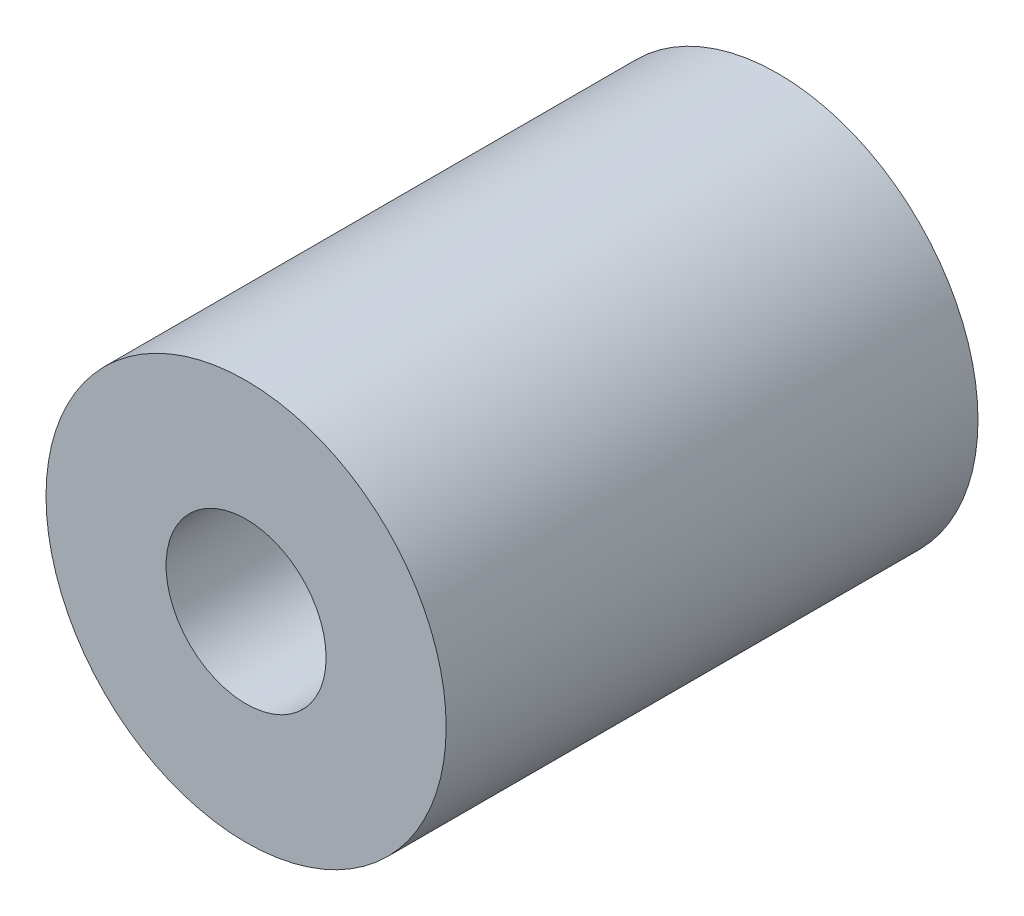
ISO-10303-21;
HEADER;
FILE_DESCRIPTION(('STEP AP214'),'2;1');
FILE_NAME('part.step','',(''),(''),'','','');
FILE_SCHEMA(('AUTOMOTIVE_DESIGN { 1 0 10303 214 1 1 1 1 }'));
ENDSEC;
DATA;
#1=APPLICATION_CONTEXT('core data for automotive mechanical design processes');
#2=APPLICATION_PROTOCOL_DEFINITION('international standard','automotive_design',2000,#1);
#3=PRODUCT_CONTEXT('',#1,'mechanical');
#4=PRODUCT('Part','Part','',(#3));
#5=PRODUCT_RELATED_PRODUCT_CATEGORY('part','',(#4));
#6=PRODUCT_DEFINITION_FORMATION('','',#4);
#7=PRODUCT_DEFINITION_CONTEXT('part definition',#1,'design');
#8=PRODUCT_DEFINITION('design','',#6,#7);
#9=PRODUCT_DEFINITION_SHAPE('','',#8);
#10=(LENGTH_UNIT() NAMED_UNIT(*) SI_UNIT(.MILLI.,.METRE.));
#11=(NAMED_UNIT(*) PLANE_ANGLE_UNIT() SI_UNIT($,.RADIAN.));
#12=(NAMED_UNIT(*) SI_UNIT($,.STERADIAN.) SOLID_ANGLE_UNIT());
#13=UNCERTAINTY_MEASURE_WITH_UNIT(LENGTH_MEASURE(1.E-05),#10,'distance_accuracy_value','');
#14=(GEOMETRIC_REPRESENTATION_CONTEXT(3) GLOBAL_UNCERTAINTY_ASSIGNED_CONTEXT((#13)) GLOBAL_UNIT_ASSIGNED_CONTEXT((#10,
#11,#12)) REPRESENTATION_CONTEXT('',''));
#15=CARTESIAN_POINT('',(0.,0.,0.));
#16=DIRECTION('',(0.,0.,1.));
#17=DIRECTION('',(1.,0.,0.));
#18=AXIS2_PLACEMENT_3D('',#15,#16,#17);
#19=CARTESIAN_POINT('',(0.,0.,7.31));
#20=DIRECTION('',(0.,0.,-1.));
#21=DIRECTION('',(-1.,0.,0.));
#22=AXIS2_PLACEMENT_3D('',#19,#20,#21);
#23=CYLINDRICAL_SURFACE('',#22,2.75);
#24=CARTESIAN_POINT('',(0.,0.,7.31));
#25=DIRECTION('',(0.,0.,1.));
#26=DIRECTION('',(1.,0.,0.));
#27=AXIS2_PLACEMENT_3D('',#24,#25,#26);
#28=CIRCLE('',#27,2.75);
#29=CARTESIAN_POINT('',(2.75,0.,7.31));
#30=VERTEX_POINT('',#29);
#31=EDGE_CURVE('E10',#30,#30,#28,.T.);
#32=ORIENTED_EDGE('',*,*,#31,.F.);
#33=EDGE_LOOP('',(#32));
#34=FACE_BOUND('',#33,.T.);
#35=CARTESIAN_POINT('',(0.,0.,0.));
#36=DIRECTION('',(0.,0.,1.));
#37=DIRECTION('',(1.,0.,0.));
#38=AXIS2_PLACEMENT_3D('',#35,#36,#37);
#39=CIRCLE('',#38,2.75);
#40=CARTESIAN_POINT('',(2.75,0.,0.));
#41=VERTEX_POINT('',#40);
#42=EDGE_CURVE('E46',#41,#41,#39,.T.);
#43=ORIENTED_EDGE('',*,*,#42,.T.);
#44=EDGE_LOOP('',(#43));
#45=FACE_BOUND('',#44,.T.);
#46=ADVANCED_FACE('F43',(#34,#45),#23,.T.);
#47=CARTESIAN_POINT('',(0.,0.,7.31));
#48=DIRECTION('',(0.,0.,1.));
#49=DIRECTION('',(1.,0.,0.));
#50=AXIS2_PLACEMENT_3D('',#47,#48,#49);
#51=PLANE('',#50);
#52=CARTESIAN_POINT('',(0.,0.,7.31));
#53=DIRECTION('',(0.,0.,1.));
#54=DIRECTION('',(1.,0.,0.));
#55=AXIS2_PLACEMENT_3D('',#52,#53,#54);
#56=CIRCLE('',#55,1.1);
#57=CARTESIAN_POINT('',(1.1,0.,7.31));
#58=VERTEX_POINT('',#57);
#59=EDGE_CURVE('E60',#58,#58,#56,.T.);
#60=ORIENTED_EDGE('',*,*,#59,.F.);
#61=EDGE_LOOP('',(#60));
#62=FACE_BOUND('',#61,.T.);
#63=ORIENTED_EDGE('',*,*,#31,.T.);
#64=EDGE_LOOP('',(#63));
#65=FACE_BOUND('',#64,.T.);
#66=ADVANCED_FACE('F67',(#62,#65),#51,.T.);
#67=CARTESIAN_POINT('',(0.,0.,0.));
#68=DIRECTION('',(0.,0.,1.));
#69=DIRECTION('',(1.,0.,0.));
#70=AXIS2_PLACEMENT_3D('',#67,#68,#69);
#71=PLANE('',#70);
#72=CARTESIAN_POINT('',(0.,0.,0.));
#73=DIRECTION('',(0.,0.,1.));
#74=DIRECTION('',(1.,0.,0.));
#75=AXIS2_PLACEMENT_3D('',#72,#73,#74);
#76=CIRCLE('',#75,1.1);
#77=CARTESIAN_POINT('',(1.1,0.,0.));
#78=VERTEX_POINT('',#77);
#79=EDGE_CURVE('E55',#78,#78,#76,.T.);
#80=ORIENTED_EDGE('',*,*,#79,.T.);
#81=EDGE_LOOP('',(#80));
#82=FACE_BOUND('',#81,.T.);
#83=ORIENTED_EDGE('',*,*,#42,.F.);
#84=EDGE_LOOP('',(#83));
#85=FACE_BOUND('',#84,.T.);
#86=ADVANCED_FACE('F69',(#82,#85),#71,.F.);
#87=CARTESIAN_POINT('',(0.,0.,7.31));
#88=DIRECTION('',(0.,0.,1.));
#89=DIRECTION('',(1.,0.,0.));
#90=AXIS2_PLACEMENT_3D('',#87,#88,#89);
#91=CYLINDRICAL_SURFACE('',#90,1.1);
#92=ORIENTED_EDGE('',*,*,#79,.F.);
#93=EDGE_LOOP('',(#92));
#94=FACE_BOUND('',#93,.T.);
#95=ORIENTED_EDGE('',*,*,#59,.T.);
#96=EDGE_LOOP('',(#95));
#97=FACE_BOUND('',#96,.T.);
#98=ADVANCED_FACE('F65',(#94,#97),#91,.F.);
#99=CLOSED_SHELL('',(#46,#66,#86,#98));
#100=MANIFOLD_SOLID_BREP('B2',#99);
#101=ADVANCED_BREP_SHAPE_REPRESENTATION('',(#18,#100),#14);
#102=SHAPE_DEFINITION_REPRESENTATION(#9,#101);
ENDSEC;
END-ISO-10303-21;
